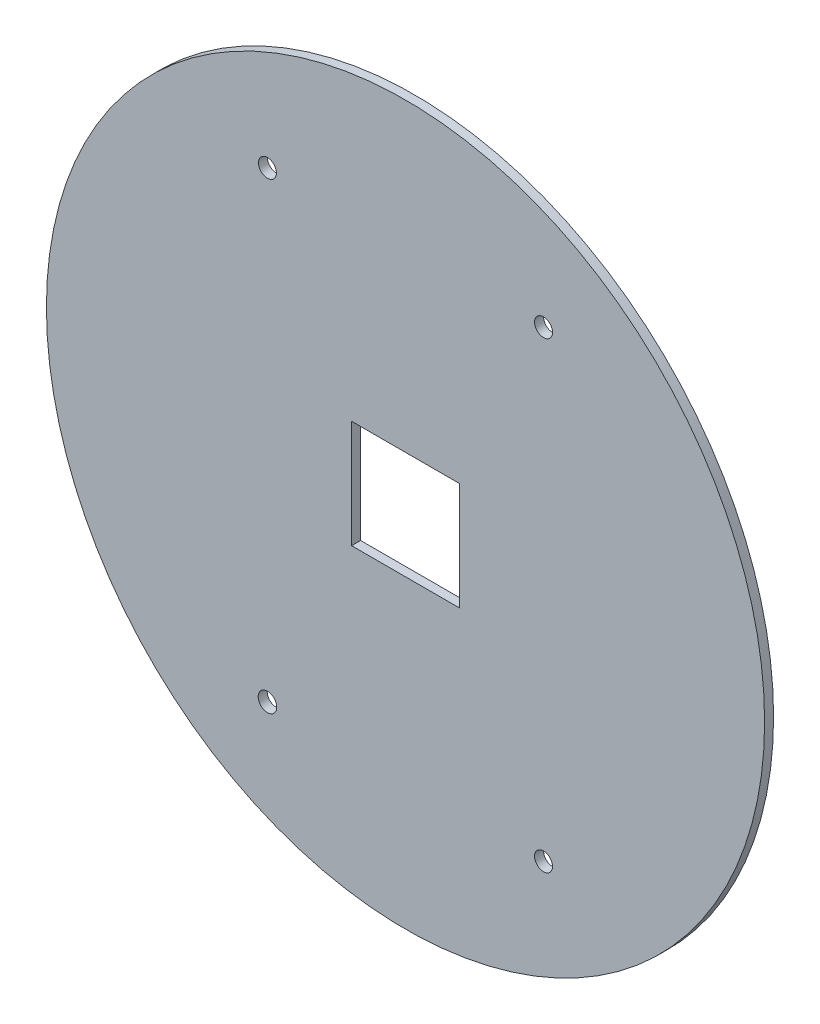
ISO-10303-21;
HEADER;
FILE_DESCRIPTION(('STEP AP214'),'2;1');
FILE_NAME('part.step','',(''),(''),'','','');
FILE_SCHEMA(('AUTOMOTIVE_DESIGN { 1 0 10303 214 1 1 1 1 }'));
ENDSEC;
DATA;
#1=APPLICATION_CONTEXT('core data for automotive mechanical design processes');
#2=APPLICATION_PROTOCOL_DEFINITION('international standard','automotive_design',2000,#1);
#3=PRODUCT_CONTEXT('',#1,'mechanical');
#4=PRODUCT('Part','Part','',(#3));
#5=PRODUCT_RELATED_PRODUCT_CATEGORY('part','',(#4));
#6=PRODUCT_DEFINITION_FORMATION('','',#4);
#7=PRODUCT_DEFINITION_CONTEXT('part definition',#1,'design');
#8=PRODUCT_DEFINITION('design','',#6,#7);
#9=PRODUCT_DEFINITION_SHAPE('','',#8);
#10=(LENGTH_UNIT() NAMED_UNIT(*) SI_UNIT(.MILLI.,.METRE.));
#11=(NAMED_UNIT(*) PLANE_ANGLE_UNIT() SI_UNIT($,.RADIAN.));
#12=(NAMED_UNIT(*) SI_UNIT($,.STERADIAN.) SOLID_ANGLE_UNIT());
#13=UNCERTAINTY_MEASURE_WITH_UNIT(LENGTH_MEASURE(1.E-05),#10,'distance_accuracy_value','');
#14=(GEOMETRIC_REPRESENTATION_CONTEXT(3) GLOBAL_UNCERTAINTY_ASSIGNED_CONTEXT((#13)) GLOBAL_UNIT_ASSIGNED_CONTEXT((#10,
#11,#12)) REPRESENTATION_CONTEXT('',''));
#15=CARTESIAN_POINT('',(0.,0.,0.));
#16=DIRECTION('',(0.,0.,1.));
#17=DIRECTION('',(1.,0.,0.));
#18=AXIS2_PLACEMENT_3D('',#15,#16,#17);
#19=CARTESIAN_POINT('',(0.,0.,5.));
#20=DIRECTION('',(0.,0.,1.));
#21=DIRECTION('',(1.,0.,0.));
#22=AXIS2_PLACEMENT_3D('',#19,#20,#21);
#23=PLANE('',#22);
#24=CARTESIAN_POINT('',(76.8801664930559,128.8,5.));
#25=DIRECTION('',(0.,0.,1.));
#26=DIRECTION('',(1.,0.,0.));
#27=AXIS2_PLACEMENT_3D('',#24,#25,#26);
#28=CIRCLE('',#27,5.00000000000001);
#29=CARTESIAN_POINT('',(81.8801664930559,128.8,5.));
#30=VERTEX_POINT('',#29);
#31=EDGE_CURVE('E206',#30,#30,#28,.T.);
#32=ORIENTED_EDGE('',*,*,#31,.F.);
#33=EDGE_LOOP('',(#32));
#34=FACE_BOUND('',#33,.T.);
#35=CARTESIAN_POINT('',(-76.8972208292648,128.789818808535,5.));
#36=DIRECTION('',(0.,0.,1.));
#37=DIRECTION('',(1.,0.,0.));
#38=AXIS2_PLACEMENT_3D('',#35,#36,#37);
#39=CIRCLE('',#38,5.00000000000001);
#40=CARTESIAN_POINT('',(-71.8972208292648,128.789818808535,5.));
#41=VERTEX_POINT('',#40);
#42=EDGE_CURVE('E102',#41,#41,#39,.T.);
#43=ORIENTED_EDGE('',*,*,#42,.F.);
#44=EDGE_LOOP('',(#43));
#45=FACE_BOUND('',#44,.T.);
#46=CARTESIAN_POINT('',(0.,0.,5.));
#47=DIRECTION('',(0.,0.,1.));
#48=DIRECTION('',(1.,0.,0.));
#49=AXIS2_PLACEMENT_3D('',#46,#47,#48);
#50=CIRCLE('',#49,200.);
#51=CARTESIAN_POINT('',(200.,0.,5.));
#52=VERTEX_POINT('',#51);
#53=EDGE_CURVE('E11',#52,#52,#50,.T.);
#54=ORIENTED_EDGE('',*,*,#53,.T.);
#55=EDGE_LOOP('',(#54));
#56=FACE_BOUND('',#55,.T.);
#57=DIRECTION('',(-1.,0.,0.));
#58=VECTOR('',#57,1.);
#59=CARTESIAN_POINT('',(-30.,30.,5.));
#60=LINE('',#59,#58);
#61=CARTESIAN_POINT('',(30.,30.,5.));
#62=VERTEX_POINT('',#61);
#63=CARTESIAN_POINT('',(-30.,30.,5.));
#64=VERTEX_POINT('',#63);
#65=EDGE_CURVE('E82',#62,#64,#60,.T.);
#66=ORIENTED_EDGE('',*,*,#65,.F.);
#67=DIRECTION('',(0.,1.,0.));
#68=VECTOR('',#67,1.);
#69=CARTESIAN_POINT('',(30.,30.,5.));
#70=LINE('',#69,#68);
#71=CARTESIAN_POINT('',(30.,-30.,5.));
#72=VERTEX_POINT('',#71);
#73=EDGE_CURVE('E74',#72,#62,#70,.T.);
#74=ORIENTED_EDGE('',*,*,#73,.F.);
#75=DIRECTION('',(1.,0.,0.));
#76=VECTOR('',#75,1.);
#77=CARTESIAN_POINT('',(-30.,-30.,5.));
#78=LINE('',#77,#76);
#79=CARTESIAN_POINT('',(-30.,-30.,5.));
#80=VERTEX_POINT('',#79);
#81=EDGE_CURVE('E96',#80,#72,#78,.T.);
#82=ORIENTED_EDGE('',*,*,#81,.F.);
#83=DIRECTION('',(0.,-1.,0.));
#84=VECTOR('',#83,1.);
#85=CARTESIAN_POINT('',(-30.,30.,5.));
#86=LINE('',#85,#84);
#87=EDGE_CURVE('E94',#64,#80,#86,.T.);
#88=ORIENTED_EDGE('',*,*,#87,.F.);
#89=EDGE_LOOP('',(#66,#74,#82,#88));
#90=FACE_BOUND('',#89,.T.);
#91=CARTESIAN_POINT('',(-76.8801664930559,-128.8,5.));
#92=DIRECTION('',(0.,0.,1.));
#93=DIRECTION('',(1.,0.,0.));
#94=AXIS2_PLACEMENT_3D('',#91,#92,#93);
#95=CIRCLE('',#94,5.16759030455916);
#96=CARTESIAN_POINT('',(-71.7125761884968,-128.8,5.));
#97=VERTEX_POINT('',#96);
#98=EDGE_CURVE('E212',#97,#97,#95,.T.);
#99=ORIENTED_EDGE('',*,*,#98,.F.);
#100=EDGE_LOOP('',(#99));
#101=FACE_BOUND('',#100,.T.);
#102=CARTESIAN_POINT('',(76.8801664930559,-128.8,5.));
#103=DIRECTION('',(0.,0.,1.));
#104=DIRECTION('',(1.,0.,0.));
#105=AXIS2_PLACEMENT_3D('',#102,#103,#104);
#106=CIRCLE('',#105,5.00000000000001);
#107=CARTESIAN_POINT('',(81.8801664930559,-128.8,5.));
#108=VERTEX_POINT('',#107);
#109=EDGE_CURVE('E197',#108,#108,#106,.T.);
#110=ORIENTED_EDGE('',*,*,#109,.F.);
#111=EDGE_LOOP('',(#110));
#112=FACE_BOUND('',#111,.T.);
#113=ADVANCED_FACE('F33',(#34,#45,#56,#90,#101,#112),#23,.T.);
#114=CARTESIAN_POINT('',(0.,0.,0.));
#115=DIRECTION('',(0.,0.,1.));
#116=DIRECTION('',(1.,0.,0.));
#117=AXIS2_PLACEMENT_3D('',#114,#115,#116);
#118=PLANE('',#117);
#119=CARTESIAN_POINT('',(0.,0.,0.));
#120=DIRECTION('',(0.,0.,1.));
#121=DIRECTION('',(1.,0.,0.));
#122=AXIS2_PLACEMENT_3D('',#119,#120,#121);
#123=CIRCLE('',#122,200.);
#124=CARTESIAN_POINT('',(200.,0.,0.));
#125=VERTEX_POINT('',#124);
#126=EDGE_CURVE('E37',#125,#125,#123,.T.);
#127=ORIENTED_EDGE('',*,*,#126,.F.);
#128=EDGE_LOOP('',(#127));
#129=FACE_BOUND('',#128,.T.);
#130=DIRECTION('',(0.,1.,0.));
#131=VECTOR('',#130,1.);
#132=CARTESIAN_POINT('',(30.,30.,0.));
#133=LINE('',#132,#131);
#134=CARTESIAN_POINT('',(30.,-30.,0.));
#135=VERTEX_POINT('',#134);
#136=CARTESIAN_POINT('',(30.,30.,0.));
#137=VERTEX_POINT('',#136);
#138=EDGE_CURVE('E56',#135,#137,#133,.T.);
#139=ORIENTED_EDGE('',*,*,#138,.T.);
#140=DIRECTION('',(-1.,0.,0.));
#141=VECTOR('',#140,1.);
#142=CARTESIAN_POINT('',(-30.,30.,0.));
#143=LINE('',#142,#141);
#144=CARTESIAN_POINT('',(-30.,30.,0.));
#145=VERTEX_POINT('',#144);
#146=EDGE_CURVE('E89',#137,#145,#143,.T.);
#147=ORIENTED_EDGE('',*,*,#146,.T.);
#148=DIRECTION('',(0.,-1.,0.));
#149=VECTOR('',#148,1.);
#150=CARTESIAN_POINT('',(-30.,30.,0.));
#151=LINE('',#150,#149);
#152=CARTESIAN_POINT('',(-30.,-30.,0.));
#153=VERTEX_POINT('',#152);
#154=EDGE_CURVE('E104',#145,#153,#151,.T.);
#155=ORIENTED_EDGE('',*,*,#154,.T.);
#156=DIRECTION('',(1.,0.,0.));
#157=VECTOR('',#156,1.);
#158=CARTESIAN_POINT('',(-30.,-30.,0.));
#159=LINE('',#158,#157);
#160=EDGE_CURVE('E83',#153,#135,#159,.T.);
#161=ORIENTED_EDGE('',*,*,#160,.T.);
#162=EDGE_LOOP('',(#139,#147,#155,#161));
#163=FACE_BOUND('',#162,.T.);
#164=CARTESIAN_POINT('',(-76.8972208292648,128.789818808535,0.));
#165=DIRECTION('',(0.,0.,1.));
#166=DIRECTION('',(1.,0.,0.));
#167=AXIS2_PLACEMENT_3D('',#164,#165,#166);
#168=CIRCLE('',#167,5.00000000000001);
#169=CARTESIAN_POINT('',(-71.8972208292648,128.789818808535,0.));
#170=VERTEX_POINT('',#169);
#171=EDGE_CURVE('E215',#170,#170,#168,.T.);
#172=ORIENTED_EDGE('',*,*,#171,.T.);
#173=EDGE_LOOP('',(#172));
#174=FACE_BOUND('',#173,.T.);
#175=CARTESIAN_POINT('',(-76.8801664930559,-128.8,0.));
#176=DIRECTION('',(0.,0.,1.));
#177=DIRECTION('',(1.,0.,0.));
#178=AXIS2_PLACEMENT_3D('',#175,#176,#177);
#179=CIRCLE('',#178,5.16759030455916);
#180=CARTESIAN_POINT('',(-71.7125761884968,-128.8,0.));
#181=VERTEX_POINT('',#180);
#182=EDGE_CURVE('E209',#181,#181,#179,.T.);
#183=ORIENTED_EDGE('',*,*,#182,.T.);
#184=EDGE_LOOP('',(#183));
#185=FACE_BOUND('',#184,.T.);
#186=CARTESIAN_POINT('',(76.8801664930559,128.8,0.));
#187=DIRECTION('',(0.,0.,1.));
#188=DIRECTION('',(1.,0.,0.));
#189=AXIS2_PLACEMENT_3D('',#186,#187,#188);
#190=CIRCLE('',#189,5.00000000000001);
#191=CARTESIAN_POINT('',(81.8801664930559,128.8,0.));
#192=VERTEX_POINT('',#191);
#193=EDGE_CURVE('E203',#192,#192,#190,.T.);
#194=ORIENTED_EDGE('',*,*,#193,.T.);
#195=EDGE_LOOP('',(#194));
#196=FACE_BOUND('',#195,.T.);
#197=CARTESIAN_POINT('',(76.8801664930559,-128.8,0.));
#198=DIRECTION('',(0.,0.,1.));
#199=DIRECTION('',(1.,0.,0.));
#200=AXIS2_PLACEMENT_3D('',#197,#198,#199);
#201=CIRCLE('',#200,5.00000000000001);
#202=CARTESIAN_POINT('',(81.8801664930559,-128.8,0.));
#203=VERTEX_POINT('',#202);
#204=EDGE_CURVE('E200',#203,#203,#201,.T.);
#205=ORIENTED_EDGE('',*,*,#204,.T.);
#206=EDGE_LOOP('',(#205));
#207=FACE_BOUND('',#206,.T.);
#208=ADVANCED_FACE('F115',(#129,#163,#174,#185,#196,#207),#118,.F.);
#209=CARTESIAN_POINT('',(0.,0.,5.));
#210=DIRECTION('',(0.,0.,-1.));
#211=DIRECTION('',(-1.,0.,0.));
#212=AXIS2_PLACEMENT_3D('',#209,#210,#211);
#213=CYLINDRICAL_SURFACE('',#212,200.);
#214=ORIENTED_EDGE('',*,*,#53,.F.);
#215=EDGE_LOOP('',(#214));
#216=FACE_BOUND('',#215,.T.);
#217=ORIENTED_EDGE('',*,*,#126,.T.);
#218=EDGE_LOOP('',(#217));
#219=FACE_BOUND('',#218,.T.);
#220=ADVANCED_FACE('F35',(#216,#219),#213,.T.);
#221=CARTESIAN_POINT('',(30.,30.,5.));
#222=DIRECTION('',(-1.,0.,0.));
#223=DIRECTION('',(0.,-1.,0.));
#224=AXIS2_PLACEMENT_3D('',#221,#222,#223);
#225=PLANE('',#224);
#226=ORIENTED_EDGE('',*,*,#138,.F.);
#227=DIRECTION('',(0.,0.,-1.));
#228=VECTOR('',#227,1.);
#229=CARTESIAN_POINT('',(30.,-30.,5.));
#230=LINE('',#229,#228);
#231=EDGE_CURVE('E78',#72,#135,#230,.T.);
#232=ORIENTED_EDGE('',*,*,#231,.F.);
#233=ORIENTED_EDGE('',*,*,#73,.T.);
#234=DIRECTION('',(0.,0.,-1.));
#235=VECTOR('',#234,1.);
#236=CARTESIAN_POINT('',(30.,30.,5.));
#237=LINE('',#236,#235);
#238=EDGE_CURVE('E77',#62,#137,#237,.T.);
#239=ORIENTED_EDGE('',*,*,#238,.T.);
#240=EDGE_LOOP('',(#226,#232,#233,#239));
#241=FACE_BOUND('',#240,.T.);
#242=ADVANCED_FACE('F76',(#241),#225,.T.);
#243=CARTESIAN_POINT('',(-30.,30.,5.));
#244=DIRECTION('',(0.,-1.,0.));
#245=DIRECTION('',(1.,0.,0.));
#246=AXIS2_PLACEMENT_3D('',#243,#244,#245);
#247=PLANE('',#246);
#248=ORIENTED_EDGE('',*,*,#146,.F.);
#249=ORIENTED_EDGE('',*,*,#238,.F.);
#250=ORIENTED_EDGE('',*,*,#65,.T.);
#251=DIRECTION('',(0.,0.,-1.));
#252=VECTOR('',#251,1.);
#253=CARTESIAN_POINT('',(-30.,30.,5.));
#254=LINE('',#253,#252);
#255=EDGE_CURVE('E90',#64,#145,#254,.T.);
#256=ORIENTED_EDGE('',*,*,#255,.T.);
#257=EDGE_LOOP('',(#248,#249,#250,#256));
#258=FACE_BOUND('',#257,.T.);
#259=ADVANCED_FACE('F86',(#258),#247,.T.);
#260=CARTESIAN_POINT('',(-30.,30.,5.));
#261=DIRECTION('',(1.,0.,0.));
#262=DIRECTION('',(0.,1.,0.));
#263=AXIS2_PLACEMENT_3D('',#260,#261,#262);
#264=PLANE('',#263);
#265=ORIENTED_EDGE('',*,*,#154,.F.);
#266=ORIENTED_EDGE('',*,*,#255,.F.);
#267=ORIENTED_EDGE('',*,*,#87,.T.);
#268=DIRECTION('',(0.,0.,-1.));
#269=VECTOR('',#268,1.);
#270=CARTESIAN_POINT('',(-30.,-30.,5.));
#271=LINE('',#270,#269);
#272=EDGE_CURVE('E48',#80,#153,#271,.T.);
#273=ORIENTED_EDGE('',*,*,#272,.T.);
#274=EDGE_LOOP('',(#265,#266,#267,#273));
#275=FACE_BOUND('',#274,.T.);
#276=ADVANCED_FACE('F113',(#275),#264,.T.);
#277=CARTESIAN_POINT('',(-30.,-30.,5.));
#278=DIRECTION('',(0.,1.,0.));
#279=DIRECTION('',(0.,0.,1.));
#280=AXIS2_PLACEMENT_3D('',#277,#278,#279);
#281=PLANE('',#280);
#282=ORIENTED_EDGE('',*,*,#160,.F.);
#283=ORIENTED_EDGE('',*,*,#272,.F.);
#284=ORIENTED_EDGE('',*,*,#81,.T.);
#285=ORIENTED_EDGE('',*,*,#231,.T.);
#286=EDGE_LOOP('',(#282,#283,#284,#285));
#287=FACE_BOUND('',#286,.T.);
#288=ADVANCED_FACE('F117',(#287),#281,.T.);
#289=CARTESIAN_POINT('',(-76.8972208292648,128.789818808535,5.));
#290=DIRECTION('',(0.,0.,-1.));
#291=DIRECTION('',(-1.,0.,0.));
#292=AXIS2_PLACEMENT_3D('',#289,#290,#291);
#293=CYLINDRICAL_SURFACE('',#292,5.00000000000001);
#294=ORIENTED_EDGE('',*,*,#42,.T.);
#295=EDGE_LOOP('',(#294));
#296=FACE_BOUND('',#295,.T.);
#297=ORIENTED_EDGE('',*,*,#171,.F.);
#298=EDGE_LOOP('',(#297));
#299=FACE_BOUND('',#298,.T.);
#300=ADVANCED_FACE('F119',(#296,#299),#293,.F.);
#301=CARTESIAN_POINT('',(-76.8801664930559,-128.8,5.));
#302=DIRECTION('',(0.,0.,-1.));
#303=DIRECTION('',(-1.,0.,0.));
#304=AXIS2_PLACEMENT_3D('',#301,#302,#303);
#305=CYLINDRICAL_SURFACE('',#304,5.16759030455916);
#306=ORIENTED_EDGE('',*,*,#98,.T.);
#307=EDGE_LOOP('',(#306));
#308=FACE_BOUND('',#307,.T.);
#309=ORIENTED_EDGE('',*,*,#182,.F.);
#310=EDGE_LOOP('',(#309));
#311=FACE_BOUND('',#310,.T.);
#312=ADVANCED_FACE('F125',(#308,#311),#305,.F.);
#313=CARTESIAN_POINT('',(76.8801664930559,128.8,5.));
#314=DIRECTION('',(0.,0.,-1.));
#315=DIRECTION('',(-1.,0.,0.));
#316=AXIS2_PLACEMENT_3D('',#313,#314,#315);
#317=CYLINDRICAL_SURFACE('',#316,5.00000000000001);
#318=ORIENTED_EDGE('',*,*,#31,.T.);
#319=EDGE_LOOP('',(#318));
#320=FACE_BOUND('',#319,.T.);
#321=ORIENTED_EDGE('',*,*,#193,.F.);
#322=EDGE_LOOP('',(#321));
#323=FACE_BOUND('',#322,.T.);
#324=ADVANCED_FACE('F170',(#320,#323),#317,.F.);
#325=CARTESIAN_POINT('',(76.8801664930559,-128.8,5.));
#326=DIRECTION('',(0.,0.,-1.));
#327=DIRECTION('',(-1.,0.,0.));
#328=AXIS2_PLACEMENT_3D('',#325,#326,#327);
#329=CYLINDRICAL_SURFACE('',#328,5.00000000000001);
#330=ORIENTED_EDGE('',*,*,#109,.T.);
#331=EDGE_LOOP('',(#330));
#332=FACE_BOUND('',#331,.T.);
#333=ORIENTED_EDGE('',*,*,#204,.F.);
#334=EDGE_LOOP('',(#333));
#335=FACE_BOUND('',#334,.T.);
#336=ADVANCED_FACE('F180',(#332,#335),#329,.F.);
#337=CLOSED_SHELL('',(#113,#208,#220,#242,#259,#276,#288,#300,#312,#324,#336));
#338=MANIFOLD_SOLID_BREP('B2',#337);
#339=ADVANCED_BREP_SHAPE_REPRESENTATION('',(#18,#338),#14);
#340=SHAPE_DEFINITION_REPRESENTATION(#9,#339);
ENDSEC;
END-ISO-10303-21;
